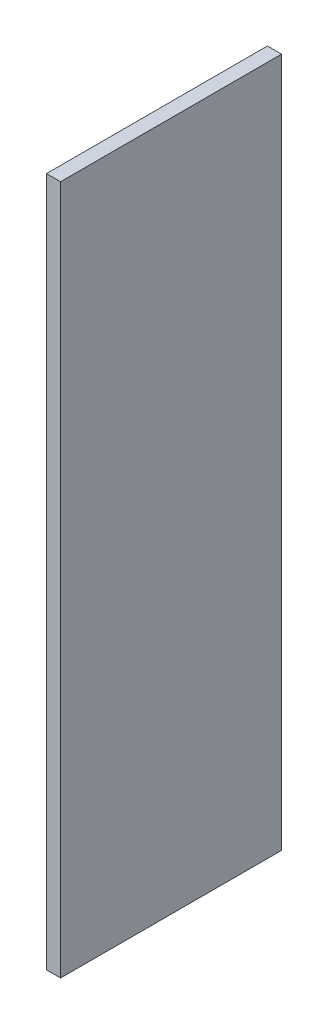
ISO-10303-21;
HEADER;
FILE_DESCRIPTION(('STEP AP214'),'2;1');
FILE_NAME('part.step','',(''),(''),'','','');
FILE_SCHEMA(('AUTOMOTIVE_DESIGN { 1 0 10303 214 1 1 1 1 }'));
ENDSEC;
DATA;
#1=APPLICATION_CONTEXT('core data for automotive mechanical design processes');
#2=APPLICATION_PROTOCOL_DEFINITION('international standard','automotive_design',2000,#1);
#3=PRODUCT_CONTEXT('',#1,'mechanical');
#4=PRODUCT('Part','Part','',(#3));
#5=PRODUCT_RELATED_PRODUCT_CATEGORY('part','',(#4));
#6=PRODUCT_DEFINITION_FORMATION('','',#4);
#7=PRODUCT_DEFINITION_CONTEXT('part definition',#1,'design');
#8=PRODUCT_DEFINITION('design','',#6,#7);
#9=PRODUCT_DEFINITION_SHAPE('','',#8);
#10=(LENGTH_UNIT() NAMED_UNIT(*) SI_UNIT(.MILLI.,.METRE.));
#11=(NAMED_UNIT(*) PLANE_ANGLE_UNIT() SI_UNIT($,.RADIAN.));
#12=(NAMED_UNIT(*) SI_UNIT($,.STERADIAN.) SOLID_ANGLE_UNIT());
#13=UNCERTAINTY_MEASURE_WITH_UNIT(LENGTH_MEASURE(1.E-05),#10,'distance_accuracy_value','');
#14=(GEOMETRIC_REPRESENTATION_CONTEXT(3) GLOBAL_UNCERTAINTY_ASSIGNED_CONTEXT((#13)) GLOBAL_UNIT_ASSIGNED_CONTEXT((#10,
#11,#12)) REPRESENTATION_CONTEXT('',''));
#15=CARTESIAN_POINT('',(0.,0.,0.));
#16=DIRECTION('',(0.,0.,1.));
#17=DIRECTION('',(1.,0.,0.));
#18=AXIS2_PLACEMENT_3D('',#15,#16,#17);
#19=CARTESIAN_POINT('',(18.,440.,141.));
#20=DIRECTION('',(0.,0.,-1.));
#21=DIRECTION('',(0.,1.,0.));
#22=AXIS2_PLACEMENT_3D('',#19,#20,#21);
#23=PLANE('',#22);
#24=DIRECTION('',(0.,-1.,0.));
#25=VECTOR('',#24,1.);
#26=CARTESIAN_POINT('',(0.,440.,141.));
#27=LINE('',#26,#25);
#28=CARTESIAN_POINT('',(0.,440.,141.));
#29=VERTEX_POINT('',#28);
#30=CARTESIAN_POINT('',(0.,-440.,141.));
#31=VERTEX_POINT('',#30);
#32=EDGE_CURVE('E98',#29,#31,#27,.T.);
#33=ORIENTED_EDGE('',*,*,#32,.T.);
#34=DIRECTION('',(-1.,0.,0.));
#35=VECTOR('',#34,1.);
#36=CARTESIAN_POINT('',(18.,-440.,141.));
#37=LINE('',#36,#35);
#38=CARTESIAN_POINT('',(18.,-440.,141.));
#39=VERTEX_POINT('',#38);
#40=EDGE_CURVE('E11',#39,#31,#37,.T.);
#41=ORIENTED_EDGE('',*,*,#40,.F.);
#42=DIRECTION('',(0.,-1.,0.));
#43=VECTOR('',#42,1.);
#44=CARTESIAN_POINT('',(18.,440.,141.));
#45=LINE('',#44,#43);
#46=CARTESIAN_POINT('',(18.,440.,141.));
#47=VERTEX_POINT('',#46);
#48=EDGE_CURVE('E86',#47,#39,#45,.T.);
#49=ORIENTED_EDGE('',*,*,#48,.F.);
#50=DIRECTION('',(-1.,0.,0.));
#51=VECTOR('',#50,1.);
#52=CARTESIAN_POINT('',(18.,440.,141.));
#53=LINE('',#52,#51);
#54=EDGE_CURVE('E94',#47,#29,#53,.T.);
#55=ORIENTED_EDGE('',*,*,#54,.T.);
#56=EDGE_LOOP('',(#33,#41,#49,#55));
#57=FACE_BOUND('',#56,.T.);
#58=ADVANCED_FACE('F35',(#57),#23,.F.);
#59=CARTESIAN_POINT('',(18.,-440.,-141.));
#60=DIRECTION('',(0.,1.,0.));
#61=DIRECTION('',(0.,0.,1.));
#62=AXIS2_PLACEMENT_3D('',#59,#60,#61);
#63=PLANE('',#62);
#64=DIRECTION('',(0.,0.,-1.));
#65=VECTOR('',#64,1.);
#66=CARTESIAN_POINT('',(0.,-440.,-141.));
#67=LINE('',#66,#65);
#68=CARTESIAN_POINT('',(0.,-440.,-141.));
#69=VERTEX_POINT('',#68);
#70=EDGE_CURVE('E90',#31,#69,#67,.T.);
#71=ORIENTED_EDGE('',*,*,#70,.T.);
#72=DIRECTION('',(-1.,0.,0.));
#73=VECTOR('',#72,1.);
#74=CARTESIAN_POINT('',(18.,-440.,-141.));
#75=LINE('',#74,#73);
#76=CARTESIAN_POINT('',(18.,-440.,-141.));
#77=VERTEX_POINT('',#76);
#78=EDGE_CURVE('E43',#77,#69,#75,.T.);
#79=ORIENTED_EDGE('',*,*,#78,.F.);
#80=DIRECTION('',(0.,0.,-1.));
#81=VECTOR('',#80,1.);
#82=CARTESIAN_POINT('',(18.,-440.,-141.));
#83=LINE('',#82,#81);
#84=EDGE_CURVE('E81',#39,#77,#83,.T.);
#85=ORIENTED_EDGE('',*,*,#84,.F.);
#86=ORIENTED_EDGE('',*,*,#40,.T.);
#87=EDGE_LOOP('',(#71,#79,#85,#86));
#88=FACE_BOUND('',#87,.T.);
#89=ADVANCED_FACE('F89',(#88),#63,.F.);
#90=CARTESIAN_POINT('',(18.,440.,-141.));
#91=DIRECTION('',(0.,0.,1.));
#92=DIRECTION('',(0.,-1.,0.));
#93=AXIS2_PLACEMENT_3D('',#90,#91,#92);
#94=PLANE('',#93);
#95=DIRECTION('',(0.,1.,0.));
#96=VECTOR('',#95,1.);
#97=CARTESIAN_POINT('',(0.,440.,-141.));
#98=LINE('',#97,#96);
#99=CARTESIAN_POINT('',(0.,440.,-141.));
#100=VERTEX_POINT('',#99);
#101=EDGE_CURVE('E68',#69,#100,#98,.T.);
#102=ORIENTED_EDGE('',*,*,#101,.T.);
#103=DIRECTION('',(-1.,0.,0.));
#104=VECTOR('',#103,1.);
#105=CARTESIAN_POINT('',(18.,440.,-141.));
#106=LINE('',#105,#104);
#107=CARTESIAN_POINT('',(18.,440.,-141.));
#108=VERTEX_POINT('',#107);
#109=EDGE_CURVE('E91',#108,#100,#106,.T.);
#110=ORIENTED_EDGE('',*,*,#109,.F.);
#111=DIRECTION('',(0.,1.,0.));
#112=VECTOR('',#111,1.);
#113=CARTESIAN_POINT('',(18.,440.,-141.));
#114=LINE('',#113,#112);
#115=EDGE_CURVE('E84',#77,#108,#114,.T.);
#116=ORIENTED_EDGE('',*,*,#115,.F.);
#117=ORIENTED_EDGE('',*,*,#78,.T.);
#118=EDGE_LOOP('',(#102,#110,#116,#117));
#119=FACE_BOUND('',#118,.T.);
#120=ADVANCED_FACE('F92',(#119),#94,.F.);
#121=CARTESIAN_POINT('',(18.,440.,-141.));
#122=DIRECTION('',(0.,-1.,0.));
#123=DIRECTION('',(0.,0.,-1.));
#124=AXIS2_PLACEMENT_3D('',#121,#122,#123);
#125=PLANE('',#124);
#126=DIRECTION('',(0.,0.,1.));
#127=VECTOR('',#126,1.);
#128=CARTESIAN_POINT('',(0.,440.,-141.));
#129=LINE('',#128,#127);
#130=EDGE_CURVE('E74',#100,#29,#129,.T.);
#131=ORIENTED_EDGE('',*,*,#130,.T.);
#132=ORIENTED_EDGE('',*,*,#54,.F.);
#133=DIRECTION('',(0.,0.,1.));
#134=VECTOR('',#133,1.);
#135=CARTESIAN_POINT('',(18.,440.,-141.));
#136=LINE('',#135,#134);
#137=EDGE_CURVE('E51',#108,#47,#136,.T.);
#138=ORIENTED_EDGE('',*,*,#137,.F.);
#139=ORIENTED_EDGE('',*,*,#109,.T.);
#140=EDGE_LOOP('',(#131,#132,#138,#139));
#141=FACE_BOUND('',#140,.T.);
#142=ADVANCED_FACE('F105',(#141),#125,.F.);
#143=CARTESIAN_POINT('',(18.,0.,0.));
#144=DIRECTION('',(-1.,0.,0.));
#145=DIRECTION('',(0.,0.,1.));
#146=AXIS2_PLACEMENT_3D('',#143,#144,#145);
#147=PLANE('',#146);
#148=ORIENTED_EDGE('',*,*,#48,.T.);
#149=ORIENTED_EDGE('',*,*,#84,.T.);
#150=ORIENTED_EDGE('',*,*,#115,.T.);
#151=ORIENTED_EDGE('',*,*,#137,.T.);
#152=EDGE_LOOP('',(#148,#149,#150,#151));
#153=FACE_BOUND('',#152,.T.);
#154=ADVANCED_FACE('F82',(#153),#147,.F.);
#155=CARTESIAN_POINT('',(0.,0.,0.));
#156=DIRECTION('',(-1.,0.,0.));
#157=DIRECTION('',(0.,0.,1.));
#158=AXIS2_PLACEMENT_3D('',#155,#156,#157);
#159=PLANE('',#158);
#160=ORIENTED_EDGE('',*,*,#32,.F.);
#161=ORIENTED_EDGE('',*,*,#130,.F.);
#162=ORIENTED_EDGE('',*,*,#101,.F.);
#163=ORIENTED_EDGE('',*,*,#70,.F.);
#164=EDGE_LOOP('',(#160,#161,#162,#163));
#165=FACE_BOUND('',#164,.T.);
#166=ADVANCED_FACE('F108',(#165),#159,.T.);
#167=CLOSED_SHELL('',(#58,#89,#120,#142,#154,#166));
#168=MANIFOLD_SOLID_BREP('B2',#167);
#169=ADVANCED_BREP_SHAPE_REPRESENTATION('',(#18,#168),#14);
#170=SHAPE_DEFINITION_REPRESENTATION(#9,#169);
ENDSEC;
END-ISO-10303-21;
